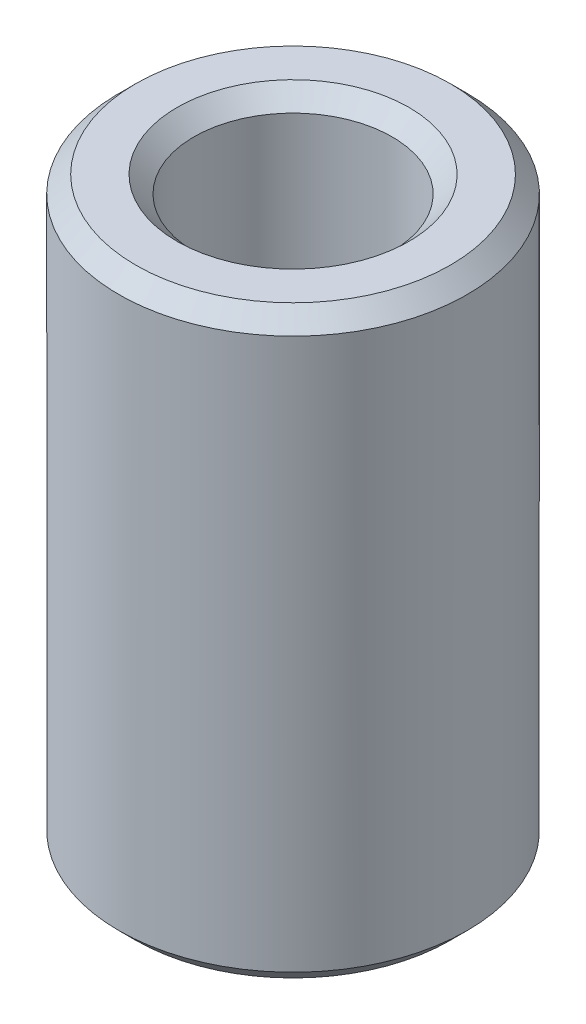
ISO-10303-21;
HEADER;
FILE_DESCRIPTION(('STEP AP214'),'2;1');
FILE_NAME('part.step','',(''),(''),'','','');
FILE_SCHEMA(('AUTOMOTIVE_DESIGN { 1 0 10303 214 1 1 1 1 }'));
ENDSEC;
DATA;
#1=APPLICATION_CONTEXT('core data for automotive mechanical design processes');
#2=APPLICATION_PROTOCOL_DEFINITION('international standard','automotive_design',2000,#1);
#3=PRODUCT_CONTEXT('',#1,'mechanical');
#4=PRODUCT('Part','Part','',(#3));
#5=PRODUCT_RELATED_PRODUCT_CATEGORY('part','',(#4));
#6=PRODUCT_DEFINITION_FORMATION('','',#4);
#7=PRODUCT_DEFINITION_CONTEXT('part definition',#1,'design');
#8=PRODUCT_DEFINITION('design','',#6,#7);
#9=PRODUCT_DEFINITION_SHAPE('','',#8);
#10=(LENGTH_UNIT() NAMED_UNIT(*) SI_UNIT(.MILLI.,.METRE.));
#11=(NAMED_UNIT(*) PLANE_ANGLE_UNIT() SI_UNIT($,.RADIAN.));
#12=(NAMED_UNIT(*) SI_UNIT($,.STERADIAN.) SOLID_ANGLE_UNIT());
#13=UNCERTAINTY_MEASURE_WITH_UNIT(LENGTH_MEASURE(1.E-05),#10,'distance_accuracy_value','');
#14=(GEOMETRIC_REPRESENTATION_CONTEXT(3) GLOBAL_UNCERTAINTY_ASSIGNED_CONTEXT((#13)) GLOBAL_UNIT_ASSIGNED_CONTEXT((#10,
#11,#12)) REPRESENTATION_CONTEXT('',''));
#15=CARTESIAN_POINT('',(0.,0.,0.));
#16=DIRECTION('',(0.,0.,1.));
#17=DIRECTION('',(1.,0.,0.));
#18=AXIS2_PLACEMENT_3D('',#15,#16,#17);
#19=CARTESIAN_POINT('',(0.,134.267300217603,0.));
#20=DIRECTION('',(0.,-1.,0.));
#21=DIRECTION('',(0.,0.,-1.));
#22=AXIS2_PLACEMENT_3D('',#19,#20,#21);
#23=CYLINDRICAL_SURFACE('',#22,40.);
#24=CARTESIAN_POINT('',(0.,3.89175861208052,0.));
#25=DIRECTION('',(0.,1.,0.));
#26=DIRECTION('',(0.,0.,1.));
#27=AXIS2_PLACEMENT_3D('',#24,#25,#26);
#28=CIRCLE('',#27,40.);
#29=CARTESIAN_POINT('',(0.,3.89175861208052,40.));
#30=VERTEX_POINT('',#29);
#31=EDGE_CURVE('E10',#30,#30,#28,.T.);
#32=ORIENTED_EDGE('',*,*,#31,.T.);
#33=EDGE_LOOP('',(#32));
#34=FACE_BOUND('',#33,.T.);
#35=CARTESIAN_POINT('',(0.,130.375541605522,0.));
#36=DIRECTION('',(0.,1.,0.));
#37=DIRECTION('',(0.,0.,1.));
#38=AXIS2_PLACEMENT_3D('',#35,#36,#37);
#39=CIRCLE('',#38,40.);
#40=CARTESIAN_POINT('',(0.,130.375541605522,-40.));
#41=VERTEX_POINT('',#40);
#42=EDGE_CURVE('E50',#41,#41,#39,.F.);
#43=ORIENTED_EDGE('',*,*,#42,.T.);
#44=EDGE_LOOP('',(#43));
#45=FACE_BOUND('',#44,.T.);
#46=ADVANCED_FACE('F39',(#34,#45),#23,.T.);
#47=CARTESIAN_POINT('',(0.,134.267300217603,0.));
#48=DIRECTION('',(0.,1.,0.));
#49=DIRECTION('',(0.,0.,1.));
#50=AXIS2_PLACEMENT_3D('',#47,#48,#49);
#51=PLANE('',#50);
#52=CARTESIAN_POINT('',(0.,134.267300217603,0.));
#53=DIRECTION('',(0.,1.,0.));
#54=DIRECTION('',(0.,0.,1.));
#55=AXIS2_PLACEMENT_3D('',#52,#53,#54);
#56=CIRCLE('',#55,26.6409831147806);
#57=CARTESIAN_POINT('',(0.,134.267300217603,26.6409831147806));
#58=VERTEX_POINT('',#57);
#59=EDGE_CURVE('E58',#58,#58,#56,.F.);
#60=ORIENTED_EDGE('',*,*,#59,.T.);
#61=EDGE_LOOP('',(#60));
#62=FACE_BOUND('',#61,.T.);
#63=CARTESIAN_POINT('',(0.,134.267300217603,0.));
#64=DIRECTION('',(0.,1.,0.));
#65=DIRECTION('',(0.,0.,1.));
#66=AXIS2_PLACEMENT_3D('',#63,#64,#65);
#67=CIRCLE('',#66,36.1082413879195);
#68=CARTESIAN_POINT('',(0.,134.267300217603,-36.1082413879195));
#69=VERTEX_POINT('',#68);
#70=EDGE_CURVE('E61',#69,#69,#67,.T.);
#71=ORIENTED_EDGE('',*,*,#70,.T.);
#72=EDGE_LOOP('',(#71));
#73=FACE_BOUND('',#72,.T.);
#74=ADVANCED_FACE('F88',(#62,#73),#51,.T.);
#75=CARTESIAN_POINT('',(0.,0.,0.));
#76=DIRECTION('',(0.,1.,0.));
#77=DIRECTION('',(0.,0.,1.));
#78=AXIS2_PLACEMENT_3D('',#75,#76,#77);
#79=PLANE('',#78);
#80=CARTESIAN_POINT('',(0.,0.,0.));
#81=DIRECTION('',(0.,1.,0.));
#82=DIRECTION('',(0.,0.,1.));
#83=AXIS2_PLACEMENT_3D('',#80,#81,#82);
#84=CIRCLE('',#83,26.6409831147806);
#85=CARTESIAN_POINT('',(0.,0.,26.6409831147806));
#86=VERTEX_POINT('',#85);
#87=EDGE_CURVE('E51',#86,#86,#84,.T.);
#88=ORIENTED_EDGE('',*,*,#87,.T.);
#89=EDGE_LOOP('',(#88));
#90=FACE_BOUND('',#89,.T.);
#91=CARTESIAN_POINT('',(0.,0.,0.));
#92=DIRECTION('',(0.,1.,0.));
#93=DIRECTION('',(0.,0.,1.));
#94=AXIS2_PLACEMENT_3D('',#91,#92,#93);
#95=CIRCLE('',#94,36.1082413879194);
#96=CARTESIAN_POINT('',(0.,0.,36.1082413879194));
#97=VERTEX_POINT('',#96);
#98=EDGE_CURVE('E54',#97,#97,#95,.F.);
#99=ORIENTED_EDGE('',*,*,#98,.T.);
#100=EDGE_LOOP('',(#99));
#101=FACE_BOUND('',#100,.T.);
#102=ADVANCED_FACE('F83',(#90,#101),#79,.F.);
#103=CARTESIAN_POINT('',(0.,134.267300217603,0.));
#104=DIRECTION('',(0.,-1.,0.));
#105=DIRECTION('',(0.,0.,-1.));
#106=AXIS2_PLACEMENT_3D('',#103,#104,#105);
#107=CYLINDRICAL_SURFACE('',#106,22.7492245027001);
#108=CARTESIAN_POINT('',(0.,130.375541605523,0.));
#109=DIRECTION('',(0.,1.,0.));
#110=DIRECTION('',(0.,0.,1.));
#111=AXIS2_PLACEMENT_3D('',#108,#109,#110);
#112=CIRCLE('',#111,22.7492245027001);
#113=CARTESIAN_POINT('',(0.,130.375541605523,22.7492245027001));
#114=VERTEX_POINT('',#113);
#115=EDGE_CURVE('E67',#114,#114,#112,.T.);
#116=ORIENTED_EDGE('',*,*,#115,.T.);
#117=EDGE_LOOP('',(#116));
#118=FACE_BOUND('',#117,.T.);
#119=CARTESIAN_POINT('',(0.,3.89175861208052,0.));
#120=DIRECTION('',(0.,1.,0.));
#121=DIRECTION('',(0.,0.,1.));
#122=AXIS2_PLACEMENT_3D('',#119,#120,#121);
#123=CIRCLE('',#122,22.7492245027001);
#124=CARTESIAN_POINT('',(0.,3.89175861208052,22.7492245027001));
#125=VERTEX_POINT('',#124);
#126=EDGE_CURVE('E69',#125,#125,#123,.F.);
#127=ORIENTED_EDGE('',*,*,#126,.T.);
#128=EDGE_LOOP('',(#127));
#129=FACE_BOUND('',#128,.T.);
#130=ADVANCED_FACE('F71',(#118,#129),#107,.F.);
#131=CARTESIAN_POINT('',(0.,130.375541605523,0.));
#132=DIRECTION('',(0.,1.,0.));
#133=DIRECTION('',(0.,0.,1.));
#134=AXIS2_PLACEMENT_3D('',#131,#132,#133);
#135=CONICAL_SURFACE('',#134,22.7492245027001,0.78539816339745);
#136=ORIENTED_EDGE('',*,*,#59,.F.);
#137=EDGE_LOOP('',(#136));
#138=FACE_BOUND('',#137,.T.);
#139=ORIENTED_EDGE('',*,*,#115,.F.);
#140=EDGE_LOOP('',(#139));
#141=FACE_BOUND('',#140,.T.);
#142=ADVANCED_FACE('F77',(#138,#141),#135,.F.);
#143=CARTESIAN_POINT('',(0.,0.,0.));
#144=DIRECTION('',(0.,-1.,0.));
#145=DIRECTION('',(0.,0.,-1.));
#146=AXIS2_PLACEMENT_3D('',#143,#144,#145);
#147=CONICAL_SURFACE('',#146,26.6409831147806,0.785398163397445);
#148=ORIENTED_EDGE('',*,*,#126,.F.);
#149=EDGE_LOOP('',(#148));
#150=FACE_BOUND('',#149,.T.);
#151=ORIENTED_EDGE('',*,*,#87,.F.);
#152=EDGE_LOOP('',(#151));
#153=FACE_BOUND('',#152,.T.);
#154=ADVANCED_FACE('F73',(#150,#153),#147,.F.);
#155=CARTESIAN_POINT('',(0.,3.89175861208052,0.));
#156=DIRECTION('',(0.,1.,0.));
#157=DIRECTION('',(0.,0.,1.));
#158=AXIS2_PLACEMENT_3D('',#155,#156,#157);
#159=CONICAL_SURFACE('',#158,40.,0.785398163397453);
#160=ORIENTED_EDGE('',*,*,#98,.F.);
#161=EDGE_LOOP('',(#160));
#162=FACE_BOUND('',#161,.T.);
#163=ORIENTED_EDGE('',*,*,#31,.F.);
#164=EDGE_LOOP('',(#163));
#165=FACE_BOUND('',#164,.T.);
#166=ADVANCED_FACE('F76',(#162,#165),#159,.T.);
#167=CARTESIAN_POINT('',(0.,134.267300217603,0.));
#168=DIRECTION('',(0.,-1.,0.));
#169=DIRECTION('',(0.,0.,-1.));
#170=AXIS2_PLACEMENT_3D('',#167,#168,#169);
#171=CONICAL_SURFACE('',#170,36.1082413879195,0.785398163397447);
#172=CARTESIAN_POINT('',(0.,130.375541605522,-40.));
#173=CARTESIAN_POINT('',(0.,130.416080757732,-39.9594608477909));
#174=CARTESIAN_POINT('',(0.,130.456619909941,-39.9189216955817));
#175=CARTESIAN_POINT('',(0.,130.537698214359,-39.8378433911633));
#176=CARTESIAN_POINT('',(0.,130.578237366568,-39.7973042389541));
#177=CARTESIAN_POINT('',(0.,130.659315670987,-39.7162259345358));
#178=CARTESIAN_POINT('',(0.,130.699854823196,-39.6756867823266));
#179=CARTESIAN_POINT('',(0.,130.780933127614,-39.5946084779083));
#180=CARTESIAN_POINT('',(0.,130.821472279823,-39.5540693256991));
#181=CARTESIAN_POINT('',(0.,130.902550584242,-39.4729910212808));
#182=CARTESIAN_POINT('',(0.,130.943089736451,-39.4324518690716));
#183=CARTESIAN_POINT('',(0.,131.024168040869,-39.3513735646533));
#184=CARTESIAN_POINT('',(0.,131.064707193078,-39.3108344124441));
#185=CARTESIAN_POINT('',(0.,131.145785497497,-39.2297561080257));
#186=CARTESIAN_POINT('',(0.,131.186324649706,-39.1892169558166));
#187=CARTESIAN_POINT('',(0.,131.267402954124,-39.1081386513982));
#188=CARTESIAN_POINT('',(0.,131.307942106333,-39.067599499189));
#189=CARTESIAN_POINT('',(0.,131.389020410752,-38.9865211947707));
#190=CARTESIAN_POINT('',(0.,131.429559562961,-38.9459820425615));
#191=CARTESIAN_POINT('',(0.,131.510637867379,-38.8649037381432));
#192=CARTESIAN_POINT('',(0.,131.551177019588,-38.824364585934));
#193=CARTESIAN_POINT('',(0.,131.632255324007,-38.7432862815157));
#194=CARTESIAN_POINT('',(0.,131.672794476216,-38.7027471293065));
#195=CARTESIAN_POINT('',(0.,131.753872780634,-38.6216688248882));
#196=CARTESIAN_POINT('',(0.,131.794411932844,-38.581129672679));
#197=CARTESIAN_POINT('',(0.,131.875490237262,-38.5000513682606));
#198=CARTESIAN_POINT('',(0.,131.916029389471,-38.4595122160515));
#199=CARTESIAN_POINT('',(0.,131.997107693889,-38.3784339116331));
#200=CARTESIAN_POINT('',(0.,132.037646846099,-38.3378947594239));
#201=CARTESIAN_POINT('',(0.,132.118725150517,-38.2568164550056));
#202=CARTESIAN_POINT('',(0.,132.159264302726,-38.2162773027964));
#203=CARTESIAN_POINT('',(0.,132.240342607144,-38.1351989983781));
#204=CARTESIAN_POINT('',(0.,132.280881759354,-38.0946598461689));
#205=CARTESIAN_POINT('',(0.,132.361960063772,-38.0135815417506));
#206=CARTESIAN_POINT('',(0.,132.402499215981,-37.9730423895414));
#207=CARTESIAN_POINT('',(0.,132.483577520399,-37.8919640851231));
#208=CARTESIAN_POINT('',(0.,132.524116672609,-37.8514249329139));
#209=CARTESIAN_POINT('',(0.,132.605194977027,-37.7703466284955));
#210=CARTESIAN_POINT('',(0.,132.645734129236,-37.7298074762864));
#211=CARTESIAN_POINT('',(0.,132.726812433654,-37.648729171868));
#212=CARTESIAN_POINT('',(0.,132.767351585864,-37.6081900196588));
#213=CARTESIAN_POINT('',(0.,132.848429890282,-37.5271117152405));
#214=CARTESIAN_POINT('',(0.,132.888969042491,-37.4865725630313));
#215=CARTESIAN_POINT('',(0.,132.970047346909,-37.405494258613));
#216=CARTESIAN_POINT('',(0.,133.010586499119,-37.3649551064038));
#217=CARTESIAN_POINT('',(0.,133.091664803537,-37.2838768019855));
#218=CARTESIAN_POINT('',(0.,133.132203955746,-37.2433376497763));
#219=CARTESIAN_POINT('',(0.,133.213282260165,-37.162259345358));
#220=CARTESIAN_POINT('',(0.,133.253821412374,-37.1217201931488));
#221=CARTESIAN_POINT('',(0.,133.334899716792,-37.0406418887304));
#222=CARTESIAN_POINT('',(0.,133.375438869001,-37.0001027365213));
#223=CARTESIAN_POINT('',(0.,133.45651717342,-36.9190244321029));
#224=CARTESIAN_POINT('',(0.,133.497056325629,-36.8784852798938));
#225=CARTESIAN_POINT('',(0.,133.578134630047,-36.7974069754754));
#226=CARTESIAN_POINT('',(0.,133.618673782256,-36.7568678232662));
#227=CARTESIAN_POINT('',(0.,133.699752086675,-36.6757895188479));
#228=CARTESIAN_POINT('',(0.,133.740291238884,-36.6352503666387));
#229=CARTESIAN_POINT('',(0.,133.821369543302,-36.5541720622204));
#230=CARTESIAN_POINT('',(0.,133.861908695511,-36.5136329100112));
#231=CARTESIAN_POINT('',(0.,133.94298699993,-36.4325546055929));
#232=CARTESIAN_POINT('',(0.,133.983526152139,-36.3920154533837));
#233=CARTESIAN_POINT('',(0.,134.064604456557,-36.3109371489653));
#234=CARTESIAN_POINT('',(0.,134.105143608766,-36.2703979967562));
#235=CARTESIAN_POINT('',(0.,134.186221913185,-36.1893196923378));
#236=CARTESIAN_POINT('',(0.,134.226761065394,-36.1487805401286));
#237=CARTESIAN_POINT('',(0.,134.267300217603,-36.1082413879195));
#238=B_SPLINE_CURVE_WITH_KNOTS('',3,(#172,#173,#174,#175,#176,#177,#178,#179,#180,#181,#182,
#183,#184,#185,#186,#187,#188,#189,#190,#191,#192,#193,#194,#195,#196,#197,#198,#199,#200,#201,
#202,#203,#204,#205,#206,#207,#208,#209,#210,#211,#212,#213,#214,#215,#216,#217,#218,#219,#220,
#221,#222,#223,#224,#225,#226,#227,#228,#229,#230,#231,#232,#233,#234,#235,#236,#237),
.UNSPECIFIED.,.F.,.F.,(4,2,2,2,2,2,2,2,2,2,2,2,2,2,2,2,2,2,2,2,2,2,2,2,2,2,2,2,2,2,2,2,4),(0.,
0.171993056583967,0.343986113167915,0.515979169751878,0.687972226335825,0.859965282919793,
1.03195833950374,1.20395139608771,1.37594445267166,1.54793750925562,1.71993056583957,
1.89192362242353,2.06391667900748,2.23590973559145,2.4079027921754,2.57989584875936,
2.75188890534331,2.92388196192725,3.09587501851122,3.26786807509517,3.43986113167914,
3.61185418826309,3.78384724484705,3.955840301431,4.12783335801496,4.29982641459891,
4.47181947118288,4.64381252776683,4.81580558435079,4.98779864093474,5.1597916975187,
5.33178475410265,5.50377781068662),.UNSPECIFIED.);
#239=EDGE_CURVE('BSEAM45',#41,#69,#238,.T.);
#240=ORIENTED_EDGE('',*,*,#42,.F.);
#241=ORIENTED_EDGE('',*,*,#70,.F.);
#242=ORIENTED_EDGE('',*,*,#239,.T.);
#243=ORIENTED_EDGE('',*,*,#239,.F.);
#244=EDGE_LOOP('',(#240,#242,#241,#243));
#245=FACE_BOUND('',#244,.T.);
#246=ADVANCED_FACE('F45',(#245),#171,.T.);
#247=CLOSED_SHELL('',(#46,#74,#102,#130,#142,#154,#166,#246));
#248=MANIFOLD_SOLID_BREP('B2',#247);
#249=ADVANCED_BREP_SHAPE_REPRESENTATION('',(#18,#248),#14);
#250=SHAPE_DEFINITION_REPRESENTATION(#9,#249);
ENDSEC;
END-ISO-10303-21;
